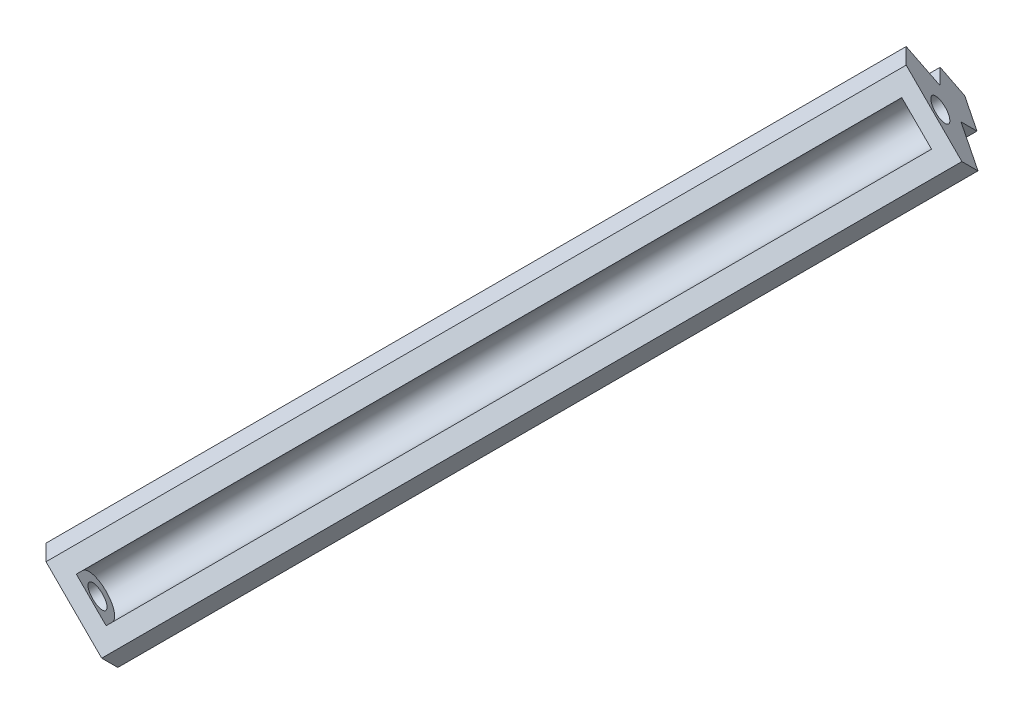
ISO-10303-21;
HEADER;
FILE_DESCRIPTION(('STEP AP214'),'2;1');
FILE_NAME('part.step','',(''),(''),'','','');
FILE_SCHEMA(('AUTOMOTIVE_DESIGN { 1 0 10303 214 1 1 1 1 }'));
ENDSEC;
DATA;
#1=APPLICATION_CONTEXT('core data for automotive mechanical design processes');
#2=APPLICATION_PROTOCOL_DEFINITION('international standard','automotive_design',2000,#1);
#3=PRODUCT_CONTEXT('',#1,'mechanical');
#4=PRODUCT('Part','Part','',(#3));
#5=PRODUCT_RELATED_PRODUCT_CATEGORY('part','',(#4));
#6=PRODUCT_DEFINITION_FORMATION('','',#4);
#7=PRODUCT_DEFINITION_CONTEXT('part definition',#1,'design');
#8=PRODUCT_DEFINITION('design','',#6,#7);
#9=PRODUCT_DEFINITION_SHAPE('','',#8);
#10=(LENGTH_UNIT() NAMED_UNIT(*) SI_UNIT(.MILLI.,.METRE.));
#11=(NAMED_UNIT(*) PLANE_ANGLE_UNIT() SI_UNIT($,.RADIAN.));
#12=(NAMED_UNIT(*) SI_UNIT($,.STERADIAN.) SOLID_ANGLE_UNIT());
#13=UNCERTAINTY_MEASURE_WITH_UNIT(LENGTH_MEASURE(1.E-05),#10,'distance_accuracy_value','');
#14=(GEOMETRIC_REPRESENTATION_CONTEXT(3) GLOBAL_UNCERTAINTY_ASSIGNED_CONTEXT((#13)) GLOBAL_UNIT_ASSIGNED_CONTEXT((#10,
#11,#12)) REPRESENTATION_CONTEXT('',''));
#15=CARTESIAN_POINT('',(0.,0.,0.));
#16=DIRECTION('',(0.,0.,1.));
#17=DIRECTION('',(1.,0.,0.));
#18=AXIS2_PLACEMENT_3D('',#15,#16,#17);
#19=CARTESIAN_POINT('',(-149.41409421049,-149.414094210489,-2.99797141819164));
#20=DIRECTION('',(0.577350269189627,0.577350269189624,-0.577350269189626));
#21=DIRECTION('',(-0.707106781186547,0.,-0.707106781186548));
#22=AXIS2_PLACEMENT_3D('',#19,#20,#21);
#23=CYLINDRICAL_SURFACE('',#22,1.54999999999993);
#24=CARTESIAN_POINT('',(-89.5073652963072,-89.5073652963067,-62.9047003323742));
#25=DIRECTION('',(0.577350269189627,0.577350269189624,-0.577350269189626));
#26=DIRECTION('',(-0.707106781186547,0.,-0.707106781186548));
#27=AXIS2_PLACEMENT_3D('',#24,#25,#26);
#28=CIRCLE('',#27,1.54999999999993);
#29=CARTESIAN_POINT('',(-90.6033808071463,-89.5073652963067,-64.0007158432133));
#30=VERTEX_POINT('',#29);
#31=EDGE_CURVE('E151',#30,#30,#28,.T.);
#32=ORIENTED_EDGE('',*,*,#31,.F.);
#33=EDGE_LOOP('',(#32));
#34=FACE_BOUND('',#33,.T.);
#35=CARTESIAN_POINT('',(-88.3526647579279,-88.3526647579275,-64.0594008707534));
#36=DIRECTION('',(0.577350269189627,0.577350269189624,-0.577350269189627));
#37=DIRECTION('',(-0.707106781186548,0.,-0.707106781186547));
#38=AXIS2_PLACEMENT_3D('',#35,#36,#37);
#39=CIRCLE('',#38,1.54999999999993);
#40=CARTESIAN_POINT('',(-89.448680268767,-88.3526647579275,-65.1554163815925));
#41=VERTEX_POINT('',#40);
#42=EDGE_CURVE('E171',#41,#41,#39,.T.);
#43=ORIENTED_EDGE('',*,*,#42,.T.);
#44=EDGE_LOOP('',(#43));
#45=FACE_BOUND('',#44,.T.);
#46=ADVANCED_FACE('F37',(#34,#45),#23,.F.);
#47=CARTESIAN_POINT('',(-37.5486428817007,-37.5486428817005,37.5486428817007));
#48=DIRECTION('',(0.577350269189627,0.577350269189624,-0.577350269189627));
#49=DIRECTION('',(-0.707106781186548,0.,-0.707106781186547));
#50=AXIS2_PLACEMENT_3D('',#47,#48,#49);
#51=PLANE('',#50);
#52=ORIENTED_EDGE('',*,*,#42,.F.);
#53=EDGE_LOOP('',(#52));
#54=FACE_BOUND('',#53,.T.);
#55=DIRECTION('',(0.707106781186533,-0.707106781186562,0.));
#56=VECTOR('',#55,1.);
#57=CARTESIAN_POINT('',(-91.2162339938929,-83.8152775310604,-62.3855828798513));
#58=LINE('',#57,#56);
#59=CARTESIAN_POINT('',(-91.2162339938929,-83.8152775310604,-62.3855828798513));
#60=VERTEX_POINT('',#59);
#61=CARTESIAN_POINT('',(-83.815277531061,-91.2162339938926,-62.3855828798516));
#62=VERTEX_POINT('',#61);
#63=EDGE_CURVE('E174',#60,#62,#58,.T.);
#64=ORIENTED_EDGE('',*,*,#63,.T.);
#65=DIRECTION('',(0.,-0.707106781186549,-0.707106781186546));
#66=VECTOR('',#65,1.);
#67=CARTESIAN_POINT('',(-83.815277531061,-89.9920560421054,-61.1614049280644));
#68=LINE('',#67,#66);
#69=CARTESIAN_POINT('',(-83.815277531061,-93.3596520875063,-64.5290009734653));
#70=VERTEX_POINT('',#69);
#71=EDGE_CURVE('E222',#62,#70,#68,.T.);
#72=ORIENTED_EDGE('',*,*,#71,.T.);
#73=DIRECTION('',(0.816496580927725,-0.408248290463863,0.408248290463864));
#74=VECTOR('',#73,1.);
#75=CARTESIAN_POINT('',(-37.5486428817008,-116.492969412186,-41.395683648785));
#76=LINE('',#75,#74);
#77=CARTESIAN_POINT('',(-88.3264211406868,-91.1040802826934,-66.7845727782781));
#78=VERTEX_POINT('',#77);
#79=EDGE_CURVE('E228',#78,#70,#76,.T.);
#80=ORIENTED_EDGE('',*,*,#79,.F.);
#81=DIRECTION('',(0.,-0.707106781186549,-0.707106781186546));
#82=VECTOR('',#81,1.);
#83=CARTESIAN_POINT('',(-88.3264211406867,-91.1040802826935,-66.7845727782782));
#84=LINE('',#83,#82);
#85=CARTESIAN_POINT('',(-88.3264211406867,-93.225400626253,-68.9058931218377));
#86=VERTEX_POINT('',#85);
#87=EDGE_CURVE('E184',#78,#86,#84,.T.);
#88=ORIENTED_EDGE('',*,*,#87,.T.);
#89=DIRECTION('',(0.816496580927725,-0.408248290463864,0.408248290463864));
#90=VECTOR('',#89,1.);
#91=CARTESIAN_POINT('',(124.58265086639,-199.679936629792,37.5486428817008));
#92=LINE('',#91,#90);
#93=CARTESIAN_POINT('',(-91.5924074643976,-91.5924074643976,-70.5388862836932));
#94=VERTEX_POINT('',#93);
#95=EDGE_CURVE('E225',#94,#86,#92,.T.);
#96=ORIENTED_EDGE('',*,*,#95,.F.);
#97=DIRECTION('',(0.408248290463862,-0.816496580927727,-0.408248290463862));
#98=VECTOR('',#97,1.);
#99=CARTESIAN_POINT('',(-145.636172047095,16.4951217009969,-16.4951217009962));
#100=LINE('',#99,#98);
#101=CARTESIAN_POINT('',(-93.2254006262533,-88.3264211406862,-68.9058931218375));
#102=VERTEX_POINT('',#101);
#103=EDGE_CURVE('E235',#102,#94,#100,.T.);
#104=ORIENTED_EDGE('',*,*,#103,.F.);
#105=DIRECTION('',(-0.707106781186542,0.,-0.707106781186553));
#106=VECTOR('',#105,1.);
#107=CARTESIAN_POINT('',(-91.1040802826956,-88.3264211406861,-66.7845727782797));
#108=LINE('',#107,#106);
#109=CARTESIAN_POINT('',(-91.104080282694,-88.3264211406862,-66.7845727782781));
#110=VERTEX_POINT('',#109);
#111=EDGE_CURVE('E230',#110,#102,#108,.T.);
#112=ORIENTED_EDGE('',*,*,#111,.F.);
#113=DIRECTION('',(0.408248290463872,-0.816496580927727,-0.408248290463852));
#114=VECTOR('',#113,1.);
#115=CARTESIAN_POINT('',(-116.492969412187,-37.5486428817018,-41.3956836487867));
#116=LINE('',#115,#114);
#117=CARTESIAN_POINT('',(-93.359652087507,-83.8152775310604,-64.5290009734654));
#118=VERTEX_POINT('',#117);
#119=EDGE_CURVE('E233',#118,#110,#116,.T.);
#120=ORIENTED_EDGE('',*,*,#119,.F.);
#121=DIRECTION('',(-0.707106781186542,0.,-0.707106781186553));
#122=VECTOR('',#121,1.);
#123=CARTESIAN_POINT('',(-89.9920560421075,-83.8152775310604,-61.1614049280659));
#124=LINE('',#123,#122);
#125=EDGE_CURVE('E219',#60,#118,#124,.T.);
#126=ORIENTED_EDGE('',*,*,#125,.F.);
#127=EDGE_LOOP('',(#64,#72,#80,#88,#96,#104,#112,#120,#126));
#128=FACE_BOUND('',#127,.T.);
#129=ADVANCED_FACE('F39',(#54,#128),#51,.T.);
#130=CARTESIAN_POINT('',(162.131293748091,-162.131293748091,0.));
#131=DIRECTION('',(0.,-0.707106781186548,-0.707106781186547));
#132=DIRECTION('',(-1.,0.,0.));
#133=AXIS2_PLACEMENT_3D('',#130,#131,#132);
#134=PLANE('',#133);
#135=DIRECTION('',(0.577350269189626,0.577350269189626,-0.577350269189626));
#136=VECTOR('',#135,1.);
#137=CARTESIAN_POINT('',(-81.0656468740454,-81.0656468740454,-81.0656468740454));
#138=LINE('',#137,#136);
#139=CARTESIAN_POINT('',(-148.757906033605,-148.757906033605,-13.3733877144856));
#140=VERTEX_POINT('',#139);
#141=EDGE_CURVE('E211',#140,#94,#138,.T.);
#142=ORIENTED_EDGE('',*,*,#141,.T.);
#143=ORIENTED_EDGE('',*,*,#95,.T.);
#144=DIRECTION('',(0.577350269189627,0.577350269189625,-0.577350269189625));
#145=VECTOR('',#144,1.);
#146=CARTESIAN_POINT('',(-50.7777782589857,-55.6767577445521,-106.454536003539));
#147=LINE('',#146,#145);
#148=CARTESIAN_POINT('',(-145.491919709894,-150.390899195461,-11.7403945526302));
#149=VERTEX_POINT('',#148);
#150=EDGE_CURVE('E217',#149,#86,#147,.T.);
#151=ORIENTED_EDGE('',*,*,#150,.F.);
#152=DIRECTION('',(-0.816496580927706,0.408248290463883,-0.408248290463883));
#153=VECTOR('',#152,1.);
#154=CARTESIAN_POINT('',(67.4171522971727,-256.845435199002,94.7141414509112));
#155=LINE('',#154,#153);
#156=EDGE_CURVE('E192',#149,#140,#155,.T.);
#157=ORIENTED_EDGE('',*,*,#156,.T.);
#158=EDGE_LOOP('',(#142,#143,#151,#157));
#159=FACE_BOUND('',#158,.T.);
#160=ADVANCED_FACE('F269',(#159),#134,.T.);
#161=CARTESIAN_POINT('',(0.,-78.9443265304859,-78.9443265304857));
#162=DIRECTION('',(0.,-0.707106781186548,-0.707106781186547));
#163=DIRECTION('',(0.,-0.707106781186547,0.707106781186548));
#164=AXIS2_PLACEMENT_3D('',#161,#162,#163);
#165=PLANE('',#164);
#166=DIRECTION('',(0.577350269189627,0.577350269189625,-0.577350269189626));
#167=VECTOR('',#166,1.);
#168=CARTESIAN_POINT('',(-154.403887137778,-157.181546279785,-0.707106781186529));
#169=LINE('',#168,#167);
#170=CARTESIAN_POINT('',(-145.491919709894,-148.269578851901,-9.61907420907051));
#171=VERTEX_POINT('',#170);
#172=EDGE_CURVE('E215',#171,#78,#169,.T.);
#173=ORIENTED_EDGE('',*,*,#172,.T.);
#174=ORIENTED_EDGE('',*,*,#79,.T.);
#175=DIRECTION('',(0.577350269189627,0.577350269189625,-0.577350269189626));
#176=VECTOR('',#175,1.);
#177=CARTESIAN_POINT('',(-143.730406757284,-153.274781313729,-4.61387174724214));
#178=LINE('',#177,#176);
#179=CARTESIAN_POINT('',(-140.980776100269,-150.525150656714,-7.36350240425758));
#180=VERTEX_POINT('',#179);
#181=EDGE_CURVE('E62',#180,#70,#178,.T.);
#182=ORIENTED_EDGE('',*,*,#181,.F.);
#183=DIRECTION('',(-0.816496580927706,0.408248290463883,-0.408248290463883));
#184=VECTOR('',#183,1.);
#185=CARTESIAN_POINT('',(-94.7141414509141,-173.658467981393,15.7698149204215));
#186=LINE('',#185,#184);
#187=EDGE_CURVE('E190',#180,#171,#186,.T.);
#188=ORIENTED_EDGE('',*,*,#187,.T.);
#189=EDGE_LOOP('',(#173,#174,#182,#188));
#190=FACE_BOUND('',#189,.T.);
#191=ADVANCED_FACE('F262',(#190),#165,.T.);
#192=CARTESIAN_POINT('',(-157.181546279789,-154.403887137774,-0.707106781186601));
#193=DIRECTION('',(-0.408248290463853,0.816496580927746,0.408248290463833));
#194=DIRECTION('',(-0.894427190999925,-0.44721359549994,0.));
#195=AXIS2_PLACEMENT_3D('',#192,#193,#194);
#196=PLANE('',#195);
#197=DIRECTION('',(0.577350269189654,0.577350269189597,-0.577350269189626));
#198=VECTOR('',#197,1.);
#199=CARTESIAN_POINT('',(-157.181546279789,-154.403887137774,-0.707106781186601));
#200=LINE('',#199,#198);
#201=CARTESIAN_POINT('',(-148.269578851904,-145.491919709891,-9.61907420907062));
#202=VERTEX_POINT('',#201);
#203=EDGE_CURVE('E193',#202,#110,#200,.T.);
#204=ORIENTED_EDGE('',*,*,#203,.T.);
#205=ORIENTED_EDGE('',*,*,#111,.T.);
#206=DIRECTION('',(0.57735026918964,0.577350269189597,-0.57735026918964));
#207=VECTOR('',#206,1.);
#208=CARTESIAN_POINT('',(52.4107714208422,57.3097509063986,-214.542065168933));
#209=LINE('',#208,#207);
#210=CARTESIAN_POINT('',(-150.390899195462,-145.491919709891,-11.7403945526286));
#211=VERTEX_POINT('',#210);
#212=EDGE_CURVE('E205',#211,#102,#209,.T.);
#213=ORIENTED_EDGE('',*,*,#212,.F.);
#214=DIRECTION('',(0.707106781186531,0.,0.707106781186564));
#215=VECTOR('',#214,1.);
#216=CARTESIAN_POINT('',(-148.269578851904,-145.491919709891,-9.61907420907063));
#217=LINE('',#216,#215);
#218=EDGE_CURVE('E199',#211,#202,#217,.T.);
#219=ORIENTED_EDGE('',*,*,#218,.T.);
#220=EDGE_LOOP('',(#204,#205,#213,#219));
#221=FACE_BOUND('',#220,.T.);
#222=ADVANCED_FACE('F274',(#221),#196,.T.);
#223=CARTESIAN_POINT('',(-78.9443265304838,0.,-78.9443265304877));
#224=DIRECTION('',(-0.70710678118653,0.,-0.707106781186565));
#225=DIRECTION('',(-0.707106781186565,0.,0.70710678118653));
#226=AXIS2_PLACEMENT_3D('',#223,#224,#225);
#227=PLANE('',#226);
#228=DIRECTION('',(0.577350269189654,0.577350269189597,-0.577350269189626));
#229=VECTOR('',#228,1.);
#230=CARTESIAN_POINT('',(-153.274781313733,-143.73040675728,-4.61387174724238));
#231=LINE('',#230,#229);
#232=CARTESIAN_POINT('',(-150.525150656717,-140.980776100265,-7.36350240425796));
#233=VERTEX_POINT('',#232);
#234=EDGE_CURVE('E208',#233,#118,#231,.T.);
#235=ORIENTED_EDGE('',*,*,#234,.T.);
#236=ORIENTED_EDGE('',*,*,#119,.T.);
#237=ORIENTED_EDGE('',*,*,#203,.F.);
#238=DIRECTION('',(-0.408248290463852,0.816496580927747,0.408248290463832));
#239=VECTOR('',#238,1.);
#240=CARTESIAN_POINT('',(-173.658467981397,-94.7141414509032,15.7698149204205));
#241=LINE('',#240,#239);
#242=EDGE_CURVE('E189',#202,#233,#241,.T.);
#243=ORIENTED_EDGE('',*,*,#242,.T.);
#244=EDGE_LOOP('',(#235,#236,#237,#243));
#245=FACE_BOUND('',#244,.T.);
#246=ADVANCED_FACE('F246',(#245),#227,.T.);
#247=CARTESIAN_POINT('',(0.,162.131293748091,-162.131293748091));
#248=DIRECTION('',(-0.707106781186547,0.,-0.707106781186548));
#249=DIRECTION('',(0.,-1.,0.));
#250=AXIS2_PLACEMENT_3D('',#247,#248,#249);
#251=PLANE('',#250);
#252=ORIENTED_EDGE('',*,*,#212,.T.);
#253=ORIENTED_EDGE('',*,*,#103,.T.);
#254=ORIENTED_EDGE('',*,*,#141,.F.);
#255=DIRECTION('',(-0.408248290463842,0.816496580927747,0.408248290463842));
#256=VECTOR('',#255,1.);
#257=CARTESIAN_POINT('',(-202.801670616305,-40.6703768681978,40.6703768682138));
#258=LINE('',#257,#256);
#259=EDGE_CURVE('E197',#140,#211,#258,.T.);
#260=ORIENTED_EDGE('',*,*,#259,.T.);
#261=EDGE_LOOP('',(#252,#253,#254,#260));
#262=FACE_BOUND('',#261,.T.);
#263=ADVANCED_FACE('F272',(#262),#251,.T.);
#264=CARTESIAN_POINT('',(-143.730406757284,-149.907185268328,-1.24627570184121));
#265=DIRECTION('',(-0.816496580927725,0.408248290463864,-0.408248290463864));
#266=DIRECTION('',(-0.447213595499959,0.,0.894427190999915));
#267=AXIS2_PLACEMENT_3D('',#264,#265,#266);
#268=PLANE('',#267);
#269=ORIENTED_EDGE('',*,*,#71,.F.);
#270=DIRECTION('',(0.577350269189627,0.577350269189624,-0.577350269189626));
#271=VECTOR('',#270,1.);
#272=CARTESIAN_POINT('',(-148.799539579668,-156.2004960425,2.59867916875568));
#273=LINE('',#272,#271);
#274=CARTESIAN_POINT('',(-140.980776100269,-148.3817325631,-5.22008431064389));
#275=VERTEX_POINT('',#274);
#276=EDGE_CURVE('E181',#275,#62,#273,.T.);
#277=ORIENTED_EDGE('',*,*,#276,.F.);
#278=DIRECTION('',(0.,0.707106781186561,0.707106781186534));
#279=VECTOR('',#278,1.);
#280=CARTESIAN_POINT('',(-140.980776100269,-147.157554611313,-3.99590635885678));
#281=LINE('',#280,#279);
#282=EDGE_CURVE('E12',#180,#275,#281,.T.);
#283=ORIENTED_EDGE('',*,*,#282,.F.);
#284=ORIENTED_EDGE('',*,*,#181,.T.);
#285=EDGE_LOOP('',(#269,#277,#283,#284));
#286=FACE_BOUND('',#285,.T.);
#287=ADVANCED_FACE('F261',(#286),#268,.F.);
#288=CARTESIAN_POINT('',(-154.403887137778,-157.181546279785,-0.707106781186529));
#289=DIRECTION('',(-0.816496580927725,0.408248290463864,-0.408248290463864));
#290=DIRECTION('',(-0.44721359549996,0.,0.894427190999915));
#291=AXIS2_PLACEMENT_3D('',#288,#289,#290);
#292=PLANE('',#291);
#293=ORIENTED_EDGE('',*,*,#87,.F.);
#294=ORIENTED_EDGE('',*,*,#172,.F.);
#295=DIRECTION('',(0.,0.707106781186561,0.707106781186534));
#296=VECTOR('',#295,1.);
#297=CARTESIAN_POINT('',(-145.491919709894,-148.269578851901,-9.61907420907075));
#298=LINE('',#297,#296);
#299=EDGE_CURVE('E46',#149,#171,#298,.T.);
#300=ORIENTED_EDGE('',*,*,#299,.F.);
#301=ORIENTED_EDGE('',*,*,#150,.T.);
#302=EDGE_LOOP('',(#293,#294,#300,#301));
#303=FACE_BOUND('',#302,.T.);
#304=ADVANCED_FACE('F265',(#303),#292,.F.);
#305=CARTESIAN_POINT('',(-149.907185268332,-143.73040675728,-1.24627570184137));
#306=DIRECTION('',(-0.408248290463853,0.816496580927746,0.408248290463832));
#307=DIRECTION('',(-0.894427190999925,-0.44721359549994,0.));
#308=AXIS2_PLACEMENT_3D('',#305,#306,#307);
#309=PLANE('',#308);
#310=DIRECTION('',(0.707106781186531,0.,0.707106781186564));
#311=VECTOR('',#310,1.);
#312=CARTESIAN_POINT('',(-147.157554611316,-140.980776100265,-3.99590635885695));
#313=LINE('',#312,#311);
#314=CARTESIAN_POINT('',(-148.3817325631,-140.980776100268,-5.22008431064384));
#315=VERTEX_POINT('',#314);
#316=EDGE_CURVE('E195',#233,#315,#313,.T.);
#317=ORIENTED_EDGE('',*,*,#316,.T.);
#318=DIRECTION('',(0.577350269189627,0.577350269189624,-0.577350269189626));
#319=VECTOR('',#318,1.);
#320=CARTESIAN_POINT('',(-156.2004960425,-148.799539579667,2.59867916875595));
#321=LINE('',#320,#319);
#322=EDGE_CURVE('E177',#315,#60,#321,.T.);
#323=ORIENTED_EDGE('',*,*,#322,.T.);
#324=ORIENTED_EDGE('',*,*,#125,.T.);
#325=ORIENTED_EDGE('',*,*,#234,.F.);
#326=EDGE_LOOP('',(#317,#323,#324,#325));
#327=FACE_BOUND('',#326,.T.);
#328=ADVANCED_FACE('F239',(#327),#309,.T.);
#329=CARTESIAN_POINT('',(-94.7141414509126,-94.7141414509031,94.7141414509083));
#330=DIRECTION('',(-0.577350269189654,-0.577350269189596,0.577350269189628));
#331=DIRECTION('',(0.707106781186531,0.,0.707106781186564));
#332=AXIS2_PLACEMENT_3D('',#329,#330,#331);
#333=PLANE('',#332);
#334=CARTESIAN_POINT('',(-145.518163327136,-145.518163327135,-6.89390230154584));
#335=DIRECTION('',(-0.577350269189654,-0.577350269189596,0.577350269189628));
#336=DIRECTION('',(0.707106781186531,0.,0.707106781186564));
#337=AXIS2_PLACEMENT_3D('',#334,#335,#336);
#338=CIRCLE('',#337,1.54999999999993);
#339=CARTESIAN_POINT('',(-144.422147816297,-145.518163327135,-5.79788679070671));
#340=VERTEX_POINT('',#339);
#341=EDGE_CURVE('E41',#340,#340,#338,.T.);
#342=ORIENTED_EDGE('',*,*,#341,.F.);
#343=EDGE_LOOP('',(#342));
#344=FACE_BOUND('',#343,.T.);
#345=DIRECTION('',(0.70710678118651,-0.707106781186585,0.));
#346=VECTOR('',#345,1.);
#347=CARTESIAN_POINT('',(-148.3817325631,-140.980776100268,-5.22008431064384));
#348=LINE('',#347,#346);
#349=EDGE_CURVE('E178',#315,#275,#348,.T.);
#350=ORIENTED_EDGE('',*,*,#349,.F.);
#351=ORIENTED_EDGE('',*,*,#316,.F.);
#352=ORIENTED_EDGE('',*,*,#242,.F.);
#353=ORIENTED_EDGE('',*,*,#218,.F.);
#354=ORIENTED_EDGE('',*,*,#259,.F.);
#355=ORIENTED_EDGE('',*,*,#156,.F.);
#356=ORIENTED_EDGE('',*,*,#299,.T.);
#357=ORIENTED_EDGE('',*,*,#187,.F.);
#358=ORIENTED_EDGE('',*,*,#282,.T.);
#359=EDGE_LOOP('',(#350,#351,#352,#353,#354,#355,#356,#357,#358));
#360=FACE_BOUND('',#359,.T.);
#361=ADVANCED_FACE('F251',(#344,#360),#333,.T.);
#362=CARTESIAN_POINT('',(-156.2004960425,-148.799539579667,2.59867916875595));
#363=DIRECTION('',(0.408248290463887,0.40824829046384,0.816496580927726));
#364=DIRECTION('',(0.894427190999905,0.,-0.447213595499979));
#365=AXIS2_PLACEMENT_3D('',#362,#363,#364);
#366=PLANE('',#365);
#367=DIRECTION('',(-0.707106781186533,0.707106781186562,0.));
#368=VECTOR('',#367,1.);
#369=CARTESIAN_POINT('',(-92.3709345322722,-84.9699780694396,-61.2308823414721));
#370=LINE('',#369,#368);
#371=CARTESIAN_POINT('',(-86.6905573220192,-90.6503552796929,-61.2308823414724));
#372=VERTEX_POINT('',#371);
#373=CARTESIAN_POINT('',(-90.6503552796933,-86.6905573220188,-61.2308823414724));
#374=VERTEX_POINT('',#373);
#375=EDGE_CURVE('E169',#372,#374,#370,.T.);
#376=ORIENTED_EDGE('',*,*,#375,.F.);
#377=DIRECTION('',(0.577350269189627,0.577350269189624,-0.577350269189626));
#378=VECTOR('',#377,1.);
#379=CARTESIAN_POINT('',(-148.403279959637,-152.363077917311,0.481840296145578));
#380=LINE('',#379,#378);
#381=CARTESIAN_POINT('',(-141.546654814468,-145.506452772142,-6.3747848490232));
#382=VERTEX_POINT('',#381);
#383=EDGE_CURVE('E163',#382,#372,#380,.T.);
#384=ORIENTED_EDGE('',*,*,#383,.F.);
#385=DIRECTION('',(0.70710678118651,-0.707106781186585,0.));
#386=VECTOR('',#385,1.);
#387=CARTESIAN_POINT('',(-147.227032024721,-139.826075561889,-6.37478484902311));
#388=LINE('',#387,#386);
#389=CARTESIAN_POINT('',(-145.506452772142,-141.546654814468,-6.37478484902311));
#390=VERTEX_POINT('',#389);
#391=EDGE_CURVE('E156',#390,#382,#388,.T.);
#392=ORIENTED_EDGE('',*,*,#391,.F.);
#393=DIRECTION('',(0.577350269189627,0.577350269189624,-0.577350269189626));
#394=VECTOR('',#393,1.);
#395=CARTESIAN_POINT('',(-152.363077917311,-148.403279959636,0.481840296145578));
#396=LINE('',#395,#394);
#397=EDGE_CURVE('E141',#390,#374,#396,.T.);
#398=ORIENTED_EDGE('',*,*,#397,.T.);
#399=EDGE_LOOP('',(#376,#384,#392,#398));
#400=FACE_BOUND('',#399,.T.);
#401=ORIENTED_EDGE('',*,*,#322,.F.);
#402=ORIENTED_EDGE('',*,*,#349,.T.);
#403=ORIENTED_EDGE('',*,*,#276,.T.);
#404=ORIENTED_EDGE('',*,*,#63,.F.);
#405=EDGE_LOOP('',(#401,#402,#403,#404));
#406=FACE_BOUND('',#405,.T.);
#407=ADVANCED_FACE('F257',(#400,#406),#366,.T.);
#408=CARTESIAN_POINT('',(-144.363462788756,-144.363462788756,-8.04860283992509));
#409=DIRECTION('',(-0.577350269189654,-0.577350269189596,0.577350269189628));
#410=DIRECTION('',(0.707106781186531,0.,0.707106781186564));
#411=AXIS2_PLACEMENT_3D('',#408,#409,#410);
#412=CIRCLE('',#411,1.54999999999993);
#413=CARTESIAN_POINT('',(-143.267447277917,-144.363462788756,-6.95258732908597));
#414=VERTEX_POINT('',#413);
#415=EDGE_CURVE('E161',#414,#414,#412,.F.);
#416=ORIENTED_EDGE('',*,*,#415,.T.);
#417=EDGE_LOOP('',(#416));
#418=FACE_BOUND('',#417,.T.);
#419=ORIENTED_EDGE('',*,*,#341,.T.);
#420=EDGE_LOOP('',(#419));
#421=FACE_BOUND('',#420,.T.);
#422=ADVANCED_FACE('F286',(#418,#421),#23,.F.);
#423=CARTESIAN_POINT('',(-152.363077917311,-148.403279959636,0.481840296145578));
#424=DIRECTION('',(-0.707106781186544,0.707106781186551,0.));
#425=DIRECTION('',(-0.707106781186551,-0.707106781186544,0.));
#426=AXIS2_PLACEMENT_3D('',#423,#424,#425);
#427=PLANE('',#426);
#428=DIRECTION('',(0.577350269189627,0.577350269189624,-0.577350269189626));
#429=VECTOR('',#428,1.);
#430=CARTESIAN_POINT('',(-153.199986912762,-149.240188955087,-1.19197769475627));
#431=LINE('',#430,#429);
#432=CARTESIAN_POINT('',(-146.343361767593,-142.383563809919,-8.04860283992515));
#433=VERTEX_POINT('',#432);
#434=CARTESIAN_POINT('',(-91.4872642751442,-87.5274663174697,-62.9047003323742));
#435=VERTEX_POINT('',#434);
#436=EDGE_CURVE('E139',#433,#435,#431,.T.);
#437=ORIENTED_EDGE('',*,*,#436,.T.);
#438=DIRECTION('',(0.408248290463865,0.408248290463858,0.816496580927727));
#439=VECTOR('',#438,1.);
#440=CARTESIAN_POINT('',(-90.6503552796933,-86.6905573220188,-61.2308823414724));
#441=LINE('',#440,#439);
#442=EDGE_CURVE('E333',#435,#374,#441,.T.);
#443=ORIENTED_EDGE('',*,*,#442,.T.);
#444=ORIENTED_EDGE('',*,*,#397,.F.);
#445=DIRECTION('',(0.408248290463868,0.408248290463861,0.816496580927725));
#446=VECTOR('',#445,1.);
#447=CARTESIAN_POINT('',(-145.506452772142,-141.546654814468,-6.37478484902332));
#448=LINE('',#447,#446);
#449=EDGE_CURVE('E54',#433,#390,#448,.T.);
#450=ORIENTED_EDGE('',*,*,#449,.F.);
#451=EDGE_LOOP('',(#437,#443,#444,#450));
#452=FACE_BOUND('',#451,.T.);
#453=ADVANCED_FACE('F296',(#452),#427,.F.);
#454=CARTESIAN_POINT('',(-151.220087933925,-151.220087933924,-1.19197769475627));
#455=DIRECTION('',(0.577350269189627,0.577350269189624,-0.577350269189626));
#456=DIRECTION('',(-0.707106781186547,0.,-0.707106781186548));
#457=AXIS2_PLACEMENT_3D('',#454,#455,#456);
#458=CYLINDRICAL_SURFACE('',#457,2.799999988);
#459=DIRECTION('',(0.577350269189627,0.577350269189624,-0.577350269189626));
#460=VECTOR('',#459,1.);
#461=CARTESIAN_POINT('',(-149.240188955088,-153.199986912761,-1.19197769475627));
#462=LINE('',#461,#460);
#463=CARTESIAN_POINT('',(-142.383563809919,-146.343361767593,-8.04860283992504));
#464=VERTEX_POINT('',#463);
#465=CARTESIAN_POINT('',(-87.5274663174701,-91.4872642751438,-62.9047003323742));
#466=VERTEX_POINT('',#465);
#467=EDGE_CURVE('E137',#464,#466,#462,.T.);
#468=ORIENTED_EDGE('',*,*,#467,.T.);
#469=CARTESIAN_POINT('',(-89.5073652963072,-89.5073652963067,-62.9047003323742));
#470=DIRECTION('',(0.577350269189627,0.577350269189624,-0.577350269189626));
#471=DIRECTION('',(-0.707106781186547,0.,-0.707106781186548));
#472=AXIS2_PLACEMENT_3D('',#469,#470,#471);
#473=CIRCLE('',#472,2.799999988);
#474=EDGE_CURVE('E335',#466,#435,#473,.T.);
#475=ORIENTED_EDGE('',*,*,#474,.T.);
#476=ORIENTED_EDGE('',*,*,#436,.F.);
#477=CARTESIAN_POINT('',(-144.363462788756,-144.363462788756,-8.04860283992509));
#478=DIRECTION('',(-0.577350269189654,-0.577350269189596,0.577350269189628));
#479=DIRECTION('',(0.707106781186531,0.,0.707106781186564));
#480=AXIS2_PLACEMENT_3D('',#477,#478,#479);
#481=CIRCLE('',#480,2.799999988);
#482=EDGE_CURVE('E133',#464,#433,#481,.F.);
#483=ORIENTED_EDGE('',*,*,#482,.F.);
#484=EDGE_LOOP('',(#468,#475,#476,#483));
#485=FACE_BOUND('',#484,.T.);
#486=ADVANCED_FACE('F135',(#485),#458,.F.);
#487=CARTESIAN_POINT('',(-148.403279959637,-152.363077917311,0.481840296145578));
#488=DIRECTION('',(0.707106781186546,-0.707106781186549,0.));
#489=DIRECTION('',(0.707106781186549,0.707106781186546,0.));
#490=AXIS2_PLACEMENT_3D('',#487,#488,#489);
#491=PLANE('',#490);
#492=ORIENTED_EDGE('',*,*,#383,.T.);
#493=DIRECTION('',(-0.408248290463864,-0.408248290463864,-0.816496580927725));
#494=VECTOR('',#493,1.);
#495=CARTESIAN_POINT('',(-86.6905573220192,-90.6503552796929,-61.2308823414724));
#496=LINE('',#495,#494);
#497=EDGE_CURVE('E150',#372,#466,#496,.T.);
#498=ORIENTED_EDGE('',*,*,#497,.T.);
#499=ORIENTED_EDGE('',*,*,#467,.F.);
#500=DIRECTION('',(-0.408248290463864,-0.408248290463864,-0.816496580927724));
#501=VECTOR('',#500,1.);
#502=CARTESIAN_POINT('',(-141.546654814468,-145.506452772142,-6.37478484902321));
#503=LINE('',#502,#501);
#504=EDGE_CURVE('E147',#382,#464,#503,.T.);
#505=ORIENTED_EDGE('',*,*,#504,.F.);
#506=EDGE_LOOP('',(#492,#498,#499,#505));
#507=FACE_BOUND('',#506,.T.);
#508=ADVANCED_FACE('F146',(#507),#491,.F.);
#509=CARTESIAN_POINT('',(-88.6704563008562,-88.6704563008557,-61.2308823414722));
#510=DIRECTION('',(0.577350269189627,0.577350269189624,-0.577350269189626));
#511=DIRECTION('',(-0.707106781186547,0.,-0.707106781186548));
#512=AXIS2_PLACEMENT_3D('',#509,#510,#511);
#513=PLANE('',#512);
#514=ORIENTED_EDGE('',*,*,#375,.T.);
#515=ORIENTED_EDGE('',*,*,#442,.F.);
#516=ORIENTED_EDGE('',*,*,#474,.F.);
#517=ORIENTED_EDGE('',*,*,#497,.F.);
#518=EDGE_LOOP('',(#514,#515,#516,#517));
#519=FACE_BOUND('',#518,.T.);
#520=ORIENTED_EDGE('',*,*,#31,.T.);
#521=EDGE_LOOP('',(#520));
#522=FACE_BOUND('',#521,.T.);
#523=ADVANCED_FACE('F331',(#519,#522),#513,.F.);
#524=CARTESIAN_POINT('',(-93.5594409125333,-93.5594409125239,93.5594409125291));
#525=DIRECTION('',(-0.577350269189654,-0.577350269189596,0.577350269189628));
#526=DIRECTION('',(0.707106781186531,0.,0.707106781186564));
#527=AXIS2_PLACEMENT_3D('',#524,#525,#526);
#528=PLANE('',#527);
#529=ORIENTED_EDGE('',*,*,#391,.T.);
#530=ORIENTED_EDGE('',*,*,#504,.T.);
#531=ORIENTED_EDGE('',*,*,#482,.T.);
#532=ORIENTED_EDGE('',*,*,#449,.T.);
#533=EDGE_LOOP('',(#529,#530,#531,#532));
#534=FACE_BOUND('',#533,.T.);
#535=ORIENTED_EDGE('',*,*,#415,.F.);
#536=EDGE_LOOP('',(#535));
#537=FACE_BOUND('',#536,.T.);
#538=ADVANCED_FACE('F153',(#534,#537),#528,.F.);
#539=CLOSED_SHELL('',(#46,#129,#160,#191,#222,#246,#263,#287,#304,#328,#361,#407,#422,#453,#486,
#508,#523,#538));
#540=MANIFOLD_SOLID_BREP('B2',#539);
#541=ADVANCED_BREP_SHAPE_REPRESENTATION('',(#18,#540),#14);
#542=SHAPE_DEFINITION_REPRESENTATION(#9,#541);
ENDSEC;
END-ISO-10303-21;
